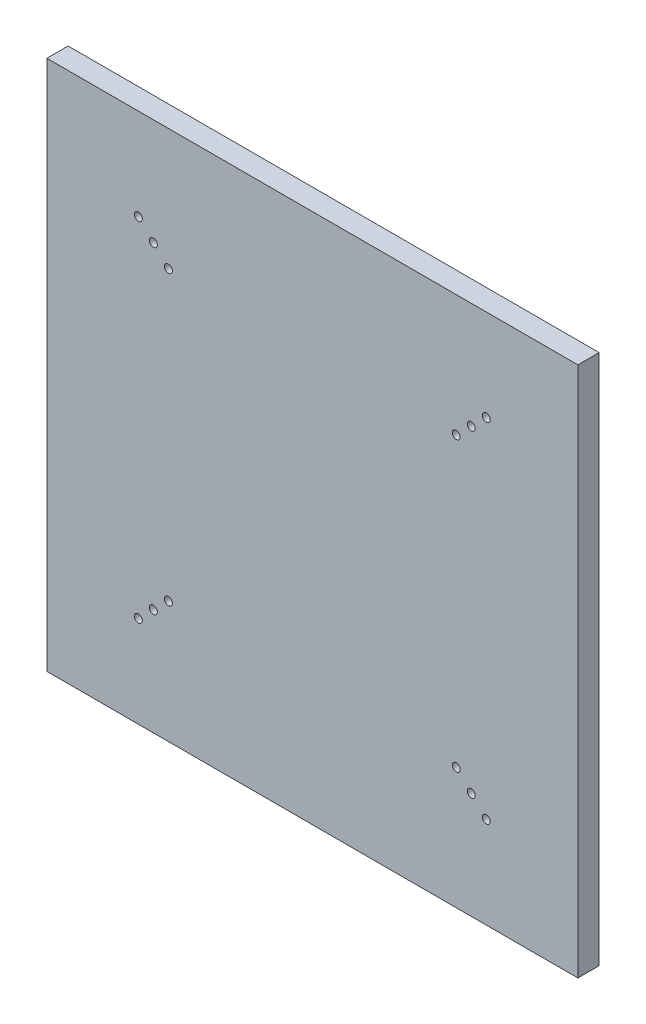
ISO-10303-21;
HEADER;
FILE_DESCRIPTION(('STEP AP214'),'2;1');
FILE_NAME('part.step','',(''),(''),'','','');
FILE_SCHEMA(('AUTOMOTIVE_DESIGN { 1 0 10303 214 1 1 1 1 }'));
ENDSEC;
DATA;
#1=APPLICATION_CONTEXT('core data for automotive mechanical design processes');
#2=APPLICATION_PROTOCOL_DEFINITION('international standard','automotive_design',2000,#1);
#3=PRODUCT_CONTEXT('',#1,'mechanical');
#4=PRODUCT('Part','Part','',(#3));
#5=PRODUCT_RELATED_PRODUCT_CATEGORY('part','',(#4));
#6=PRODUCT_DEFINITION_FORMATION('','',#4);
#7=PRODUCT_DEFINITION_CONTEXT('part definition',#1,'design');
#8=PRODUCT_DEFINITION('design','',#6,#7);
#9=PRODUCT_DEFINITION_SHAPE('','',#8);
#10=(LENGTH_UNIT() NAMED_UNIT(*) SI_UNIT(.MILLI.,.METRE.));
#11=(NAMED_UNIT(*) PLANE_ANGLE_UNIT() SI_UNIT($,.RADIAN.));
#12=(NAMED_UNIT(*) SI_UNIT($,.STERADIAN.) SOLID_ANGLE_UNIT());
#13=UNCERTAINTY_MEASURE_WITH_UNIT(LENGTH_MEASURE(1.E-05),#10,'distance_accuracy_value','');
#14=(GEOMETRIC_REPRESENTATION_CONTEXT(3) GLOBAL_UNCERTAINTY_ASSIGNED_CONTEXT((#13)) GLOBAL_UNIT_ASSIGNED_CONTEXT((#10,
#11,#12)) REPRESENTATION_CONTEXT('',''));
#15=CARTESIAN_POINT('',(0.,0.,0.));
#16=DIRECTION('',(0.,0.,1.));
#17=DIRECTION('',(1.,0.,0.));
#18=AXIS2_PLACEMENT_3D('',#15,#16,#17);
#19=CARTESIAN_POINT('',(0.,0.,8.));
#20=DIRECTION('',(1.,0.,0.));
#21=DIRECTION('',(0.,0.,-1.));
#22=AXIS2_PLACEMENT_3D('',#19,#20,#21);
#23=PLANE('',#22);
#24=DIRECTION('',(0.,-1.,0.));
#25=VECTOR('',#24,1.);
#26=CARTESIAN_POINT('',(0.,0.,0.));
#27=LINE('',#26,#25);
#28=CARTESIAN_POINT('',(0.,200.,0.));
#29=VERTEX_POINT('',#28);
#30=CARTESIAN_POINT('',(0.,0.,0.));
#31=VERTEX_POINT('',#30);
#32=EDGE_CURVE('E101',#29,#31,#27,.T.);
#33=ORIENTED_EDGE('',*,*,#32,.T.);
#34=DIRECTION('',(0.,0.,-1.));
#35=VECTOR('',#34,1.);
#36=CARTESIAN_POINT('',(0.,0.,8.));
#37=LINE('',#36,#35);
#38=CARTESIAN_POINT('',(0.,0.,8.));
#39=VERTEX_POINT('',#38);
#40=EDGE_CURVE('E11',#39,#31,#37,.T.);
#41=ORIENTED_EDGE('',*,*,#40,.F.);
#42=DIRECTION('',(0.,-1.,0.));
#43=VECTOR('',#42,1.);
#44=CARTESIAN_POINT('',(0.,0.,8.));
#45=LINE('',#44,#43);
#46=CARTESIAN_POINT('',(0.,200.,8.));
#47=VERTEX_POINT('',#46);
#48=EDGE_CURVE('E88',#47,#39,#45,.T.);
#49=ORIENTED_EDGE('',*,*,#48,.F.);
#50=DIRECTION('',(0.,0.,-1.));
#51=VECTOR('',#50,1.);
#52=CARTESIAN_POINT('',(0.,200.,8.));
#53=LINE('',#52,#51);
#54=EDGE_CURVE('E97',#47,#29,#53,.T.);
#55=ORIENTED_EDGE('',*,*,#54,.T.);
#56=EDGE_LOOP('',(#33,#41,#49,#55));
#57=FACE_BOUND('',#56,.T.);
#58=ADVANCED_FACE('F35',(#57),#23,.F.);
#59=CARTESIAN_POINT('',(0.,0.,8.));
#60=DIRECTION('',(0.,1.,0.));
#61=DIRECTION('',(0.,0.,1.));
#62=AXIS2_PLACEMENT_3D('',#59,#60,#61);
#63=PLANE('',#62);
#64=DIRECTION('',(1.,0.,0.));
#65=VECTOR('',#64,1.);
#66=CARTESIAN_POINT('',(0.,0.,0.));
#67=LINE('',#66,#65);
#68=CARTESIAN_POINT('',(200.,0.,0.));
#69=VERTEX_POINT('',#68);
#70=EDGE_CURVE('E92',#31,#69,#67,.T.);
#71=ORIENTED_EDGE('',*,*,#70,.T.);
#72=DIRECTION('',(0.,0.,-1.));
#73=VECTOR('',#72,1.);
#74=CARTESIAN_POINT('',(200.,0.,8.));
#75=LINE('',#74,#73);
#76=CARTESIAN_POINT('',(200.,0.,8.));
#77=VERTEX_POINT('',#76);
#78=EDGE_CURVE('E44',#77,#69,#75,.T.);
#79=ORIENTED_EDGE('',*,*,#78,.F.);
#80=DIRECTION('',(1.,0.,0.));
#81=VECTOR('',#80,1.);
#82=CARTESIAN_POINT('',(0.,0.,8.));
#83=LINE('',#82,#81);
#84=EDGE_CURVE('E83',#39,#77,#83,.T.);
#85=ORIENTED_EDGE('',*,*,#84,.F.);
#86=ORIENTED_EDGE('',*,*,#40,.T.);
#87=EDGE_LOOP('',(#71,#79,#85,#86));
#88=FACE_BOUND('',#87,.T.);
#89=ADVANCED_FACE('F91',(#88),#63,.F.);
#90=CARTESIAN_POINT('',(200.,0.,8.));
#91=DIRECTION('',(-1.,0.,0.));
#92=DIRECTION('',(0.,0.,1.));
#93=AXIS2_PLACEMENT_3D('',#90,#91,#92);
#94=PLANE('',#93);
#95=DIRECTION('',(0.,1.,0.));
#96=VECTOR('',#95,1.);
#97=CARTESIAN_POINT('',(200.,0.,0.));
#98=LINE('',#97,#96);
#99=CARTESIAN_POINT('',(200.,200.,0.));
#100=VERTEX_POINT('',#99);
#101=EDGE_CURVE('E70',#69,#100,#98,.T.);
#102=ORIENTED_EDGE('',*,*,#101,.T.);
#103=DIRECTION('',(0.,0.,-1.));
#104=VECTOR('',#103,1.);
#105=CARTESIAN_POINT('',(200.,200.,8.));
#106=LINE('',#105,#104);
#107=CARTESIAN_POINT('',(200.,200.,8.));
#108=VERTEX_POINT('',#107);
#109=EDGE_CURVE('E93',#108,#100,#106,.T.);
#110=ORIENTED_EDGE('',*,*,#109,.F.);
#111=DIRECTION('',(0.,1.,0.));
#112=VECTOR('',#111,1.);
#113=CARTESIAN_POINT('',(200.,0.,8.));
#114=LINE('',#113,#112);
#115=EDGE_CURVE('E86',#77,#108,#114,.T.);
#116=ORIENTED_EDGE('',*,*,#115,.F.);
#117=ORIENTED_EDGE('',*,*,#78,.T.);
#118=EDGE_LOOP('',(#102,#110,#116,#117));
#119=FACE_BOUND('',#118,.T.);
#120=ADVANCED_FACE('F95',(#119),#94,.F.);
#121=CARTESIAN_POINT('',(0.,200.,8.));
#122=DIRECTION('',(0.,-1.,0.));
#123=DIRECTION('',(0.,0.,-1.));
#124=AXIS2_PLACEMENT_3D('',#121,#122,#123);
#125=PLANE('',#124);
#126=DIRECTION('',(-1.,0.,0.));
#127=VECTOR('',#126,1.);
#128=CARTESIAN_POINT('',(0.,200.,0.));
#129=LINE('',#128,#127);
#130=EDGE_CURVE('E76',#100,#29,#129,.T.);
#131=ORIENTED_EDGE('',*,*,#130,.T.);
#132=ORIENTED_EDGE('',*,*,#54,.F.);
#133=DIRECTION('',(-1.,0.,0.));
#134=VECTOR('',#133,1.);
#135=CARTESIAN_POINT('',(0.,200.,8.));
#136=LINE('',#135,#134);
#137=EDGE_CURVE('E53',#108,#47,#136,.T.);
#138=ORIENTED_EDGE('',*,*,#137,.F.);
#139=ORIENTED_EDGE('',*,*,#109,.T.);
#140=EDGE_LOOP('',(#131,#132,#138,#139));
#141=FACE_BOUND('',#140,.T.);
#142=ADVANCED_FACE('F237',(#141),#125,.F.);
#143=CARTESIAN_POINT('',(0.,0.,8.));
#144=DIRECTION('',(0.,0.,-1.));
#145=DIRECTION('',(-1.,0.,0.));
#146=AXIS2_PLACEMENT_3D('',#143,#144,#145);
#147=PLANE('',#146);
#148=CARTESIAN_POINT('',(165.495689011695,165.559169034978,8.));
#149=DIRECTION('',(0.,0.,1.));
#150=DIRECTION('',(0.,1.,0.));
#151=AXIS2_PLACEMENT_3D('',#148,#149,#150);
#152=CIRCLE('',#151,1.5);
#153=CARTESIAN_POINT('',(165.495689011695,167.059169034978,8.));
#154=VERTEX_POINT('',#153);
#155=EDGE_CURVE('E161',#154,#154,#152,.T.);
#156=ORIENTED_EDGE('',*,*,#155,.F.);
#157=EDGE_LOOP('',(#156));
#158=FACE_BOUND('',#157,.T.);
#159=CARTESIAN_POINT('',(45.7545394640067,154.245460535993,8.));
#160=DIRECTION('',(0.,0.,1.));
#161=DIRECTION('',(-1.,0.,0.));
#162=AXIS2_PLACEMENT_3D('',#159,#160,#161);
#163=CIRCLE('',#162,1.5);
#164=CARTESIAN_POINT('',(44.2545394640067,154.245460535993,8.));
#165=VERTEX_POINT('',#164);
#166=EDGE_CURVE('E181',#165,#165,#163,.T.);
#167=ORIENTED_EDGE('',*,*,#166,.F.);
#168=EDGE_LOOP('',(#167));
#169=FACE_BOUND('',#168,.T.);
#170=CARTESIAN_POINT('',(34.4408309650227,34.5043109883043,8.));
#171=DIRECTION('',(0.,0.,1.));
#172=DIRECTION('',(0.,-1.,0.));
#173=AXIS2_PLACEMENT_3D('',#170,#171,#172);
#174=CIRCLE('',#173,1.5);
#175=CARTESIAN_POINT('',(34.4408309650227,33.0043109883043,8.));
#176=VERTEX_POINT('',#175);
#177=EDGE_CURVE('E173',#176,#176,#174,.T.);
#178=ORIENTED_EDGE('',*,*,#177,.F.);
#179=EDGE_LOOP('',(#178));
#180=FACE_BOUND('',#179,.T.);
#181=CARTESIAN_POINT('',(40.097685214515,40.1611652377968,8.));
#182=DIRECTION('',(0.,0.,1.));
#183=DIRECTION('',(0.,-1.,0.));
#184=AXIS2_PLACEMENT_3D('',#181,#182,#183);
#185=CIRCLE('',#184,1.5);
#186=CARTESIAN_POINT('',(40.097685214515,38.6611652377968,8.));
#187=VERTEX_POINT('',#186);
#188=EDGE_CURVE('E170',#187,#187,#185,.T.);
#189=ORIENTED_EDGE('',*,*,#188,.F.);
#190=EDGE_LOOP('',(#189));
#191=FACE_BOUND('',#190,.T.);
#192=CARTESIAN_POINT('',(45.7545394640074,45.8180194872892,8.));
#193=DIRECTION('',(0.,0.,1.));
#194=DIRECTION('',(0.,-1.,0.));
#195=AXIS2_PLACEMENT_3D('',#192,#193,#194);
#196=CIRCLE('',#195,1.5);
#197=CARTESIAN_POINT('',(45.7545394640074,44.3180194872892,8.));
#198=VERTEX_POINT('',#197);
#199=EDGE_CURVE('E174',#198,#198,#196,.T.);
#200=ORIENTED_EDGE('',*,*,#199,.F.);
#201=EDGE_LOOP('',(#200));
#202=FACE_BOUND('',#201,.T.);
#203=CARTESIAN_POINT('',(40.0976852145144,159.902314785486,8.));
#204=DIRECTION('',(0.,0.,1.));
#205=DIRECTION('',(-1.,0.,0.));
#206=AXIS2_PLACEMENT_3D('',#203,#204,#205);
#207=CIRCLE('',#206,1.5);
#208=CARTESIAN_POINT('',(38.5976852145144,159.902314785486,8.));
#209=VERTEX_POINT('',#208);
#210=EDGE_CURVE('E184',#209,#209,#207,.T.);
#211=ORIENTED_EDGE('',*,*,#210,.F.);
#212=EDGE_LOOP('',(#211));
#213=FACE_BOUND('',#212,.T.);
#214=CARTESIAN_POINT('',(34.440830965022,165.559169034978,8.));
#215=DIRECTION('',(0.,0.,1.));
#216=DIRECTION('',(-1.,0.,0.));
#217=AXIS2_PLACEMENT_3D('',#214,#215,#216);
#218=CIRCLE('',#217,1.5);
#219=CARTESIAN_POINT('',(32.940830965022,165.559169034978,8.));
#220=VERTEX_POINT('',#219);
#221=EDGE_CURVE('E200',#220,#220,#218,.T.);
#222=ORIENTED_EDGE('',*,*,#221,.F.);
#223=EDGE_LOOP('',(#222));
#224=FACE_BOUND('',#223,.T.);
#225=CARTESIAN_POINT('',(154.18198051271,154.245460535993,8.));
#226=DIRECTION('',(0.,0.,1.));
#227=DIRECTION('',(0.,1.,0.));
#228=AXIS2_PLACEMENT_3D('',#225,#226,#227);
#229=CIRCLE('',#228,1.5);
#230=CARTESIAN_POINT('',(154.18198051271,155.745460535993,8.));
#231=VERTEX_POINT('',#230);
#232=EDGE_CURVE('E194',#231,#231,#229,.T.);
#233=ORIENTED_EDGE('',*,*,#232,.F.);
#234=EDGE_LOOP('',(#233));
#235=FACE_BOUND('',#234,.T.);
#236=CARTESIAN_POINT('',(159.838834762202,159.902314785486,8.));
#237=DIRECTION('',(0.,0.,1.));
#238=DIRECTION('',(0.,1.,0.));
#239=AXIS2_PLACEMENT_3D('',#236,#237,#238);
#240=CIRCLE('',#239,1.5);
#241=CARTESIAN_POINT('',(159.838834762202,161.402314785486,8.));
#242=VERTEX_POINT('',#241);
#243=EDGE_CURVE('E165',#242,#242,#240,.T.);
#244=ORIENTED_EDGE('',*,*,#243,.F.);
#245=EDGE_LOOP('',(#244));
#246=FACE_BOUND('',#245,.T.);
#247=CARTESIAN_POINT('',(165.495689011695,34.5043109883051,8.));
#248=DIRECTION('',(0.,0.,1.));
#249=DIRECTION('',(1.,0.,0.));
#250=AXIS2_PLACEMENT_3D('',#247,#248,#249);
#251=CIRCLE('',#250,1.5);
#252=CARTESIAN_POINT('',(166.995689011695,34.5043109883051,8.));
#253=VERTEX_POINT('',#252);
#254=EDGE_CURVE('E104',#253,#253,#251,.T.);
#255=ORIENTED_EDGE('',*,*,#254,.F.);
#256=EDGE_LOOP('',(#255));
#257=FACE_BOUND('',#256,.T.);
#258=CARTESIAN_POINT('',(159.838834762203,40.1611652377974,8.));
#259=DIRECTION('',(0.,0.,1.));
#260=DIRECTION('',(1.,0.,0.));
#261=AXIS2_PLACEMENT_3D('',#258,#259,#260);
#262=CIRCLE('',#261,1.5);
#263=CARTESIAN_POINT('',(161.338834762203,40.1611652377974,8.));
#264=VERTEX_POINT('',#263);
#265=EDGE_CURVE('E221',#264,#264,#262,.T.);
#266=ORIENTED_EDGE('',*,*,#265,.F.);
#267=EDGE_LOOP('',(#266));
#268=FACE_BOUND('',#267,.T.);
#269=CARTESIAN_POINT('',(154.18198051271,45.8180194872898,8.));
#270=DIRECTION('',(0.,0.,1.));
#271=DIRECTION('',(1.,0.,0.));
#272=AXIS2_PLACEMENT_3D('',#269,#270,#271);
#273=CIRCLE('',#272,1.5);
#274=CARTESIAN_POINT('',(155.68198051271,45.8180194872898,8.));
#275=VERTEX_POINT('',#274);
#276=EDGE_CURVE('E227',#275,#275,#273,.T.);
#277=ORIENTED_EDGE('',*,*,#276,.F.);
#278=EDGE_LOOP('',(#277));
#279=FACE_BOUND('',#278,.T.);
#280=ORIENTED_EDGE('',*,*,#48,.T.);
#281=ORIENTED_EDGE('',*,*,#84,.T.);
#282=ORIENTED_EDGE('',*,*,#115,.T.);
#283=ORIENTED_EDGE('',*,*,#137,.T.);
#284=EDGE_LOOP('',(#280,#281,#282,#283));
#285=FACE_BOUND('',#284,.T.);
#286=ADVANCED_FACE('F84',(#158,#169,#180,#191,#202,#213,#224,#235,#246,#257,#268,#279,#285),
#147,.F.);
#287=CARTESIAN_POINT('',(0.,0.,0.));
#288=DIRECTION('',(0.,0.,-1.));
#289=DIRECTION('',(-1.,0.,0.));
#290=AXIS2_PLACEMENT_3D('',#287,#288,#289);
#291=PLANE('',#290);
#292=CARTESIAN_POINT('',(159.838834762202,159.902314785486,0.));
#293=DIRECTION('',(0.,0.,-1.));
#294=DIRECTION('',(-1.,0.,0.));
#295=AXIS2_PLACEMENT_3D('',#292,#293,#294);
#296=CIRCLE('',#295,2.5);
#297=CARTESIAN_POINT('',(157.338834762202,159.902314785486,0.));
#298=VERTEX_POINT('',#297);
#299=EDGE_CURVE('E38',#298,#298,#296,.T.);
#300=ORIENTED_EDGE('',*,*,#299,.F.);
#301=EDGE_LOOP('',(#300));
#302=FACE_BOUND('',#301,.T.);
#303=CARTESIAN_POINT('',(165.495689011695,165.559169034978,0.));
#304=DIRECTION('',(0.,0.,-1.));
#305=DIRECTION('',(-1.,0.,0.));
#306=AXIS2_PLACEMENT_3D('',#303,#304,#305);
#307=CIRCLE('',#306,2.5);
#308=CARTESIAN_POINT('',(162.995689011695,165.559169034978,0.));
#309=VERTEX_POINT('',#308);
#310=EDGE_CURVE('E142',#309,#309,#307,.T.);
#311=ORIENTED_EDGE('',*,*,#310,.F.);
#312=EDGE_LOOP('',(#311));
#313=FACE_BOUND('',#312,.T.);
#314=CARTESIAN_POINT('',(45.7545394640067,154.245460535993,0.));
#315=DIRECTION('',(0.,0.,-1.));
#316=DIRECTION('',(-1.,0.,0.));
#317=AXIS2_PLACEMENT_3D('',#314,#315,#316);
#318=CIRCLE('',#317,2.5);
#319=CARTESIAN_POINT('',(43.2545394640067,154.245460535993,0.));
#320=VERTEX_POINT('',#319);
#321=EDGE_CURVE('E140',#320,#320,#318,.T.);
#322=ORIENTED_EDGE('',*,*,#321,.F.);
#323=EDGE_LOOP('',(#322));
#324=FACE_BOUND('',#323,.T.);
#325=CARTESIAN_POINT('',(40.0976852145144,159.902314785486,0.));
#326=DIRECTION('',(0.,0.,-1.));
#327=DIRECTION('',(-1.,0.,0.));
#328=AXIS2_PLACEMENT_3D('',#325,#326,#327);
#329=CIRCLE('',#328,2.5);
#330=CARTESIAN_POINT('',(37.5976852145144,159.902314785486,0.));
#331=VERTEX_POINT('',#330);
#332=EDGE_CURVE('E137',#331,#331,#329,.T.);
#333=ORIENTED_EDGE('',*,*,#332,.F.);
#334=EDGE_LOOP('',(#333));
#335=FACE_BOUND('',#334,.T.);
#336=CARTESIAN_POINT('',(34.440830965022,165.559169034978,0.));
#337=DIRECTION('',(0.,0.,-1.));
#338=DIRECTION('',(-1.,0.,0.));
#339=AXIS2_PLACEMENT_3D('',#336,#337,#338);
#340=CIRCLE('',#339,2.5);
#341=CARTESIAN_POINT('',(31.940830965022,165.559169034978,0.));
#342=VERTEX_POINT('',#341);
#343=EDGE_CURVE('E134',#342,#342,#340,.T.);
#344=ORIENTED_EDGE('',*,*,#343,.F.);
#345=EDGE_LOOP('',(#344));
#346=FACE_BOUND('',#345,.T.);
#347=CARTESIAN_POINT('',(45.7545394640074,45.8180194872892,0.));
#348=DIRECTION('',(0.,0.,-1.));
#349=DIRECTION('',(-1.,0.,0.));
#350=AXIS2_PLACEMENT_3D('',#347,#348,#349);
#351=CIRCLE('',#350,2.5);
#352=CARTESIAN_POINT('',(43.2545394640074,45.8180194872892,0.));
#353=VERTEX_POINT('',#352);
#354=EDGE_CURVE('E131',#353,#353,#351,.T.);
#355=ORIENTED_EDGE('',*,*,#354,.F.);
#356=EDGE_LOOP('',(#355));
#357=FACE_BOUND('',#356,.T.);
#358=CARTESIAN_POINT('',(40.097685214515,40.1611652377968,0.));
#359=DIRECTION('',(0.,0.,-1.));
#360=DIRECTION('',(-1.,0.,0.));
#361=AXIS2_PLACEMENT_3D('',#358,#359,#360);
#362=CIRCLE('',#361,2.5);
#363=CARTESIAN_POINT('',(37.597685214515,40.1611652377968,0.));
#364=VERTEX_POINT('',#363);
#365=EDGE_CURVE('E128',#364,#364,#362,.T.);
#366=ORIENTED_EDGE('',*,*,#365,.F.);
#367=EDGE_LOOP('',(#366));
#368=FACE_BOUND('',#367,.T.);
#369=CARTESIAN_POINT('',(34.4408309650227,34.5043109883043,0.));
#370=DIRECTION('',(0.,0.,-1.));
#371=DIRECTION('',(-1.,0.,0.));
#372=AXIS2_PLACEMENT_3D('',#369,#370,#371);
#373=CIRCLE('',#372,2.5);
#374=CARTESIAN_POINT('',(31.9408309650227,34.5043109883043,0.));
#375=VERTEX_POINT('',#374);
#376=EDGE_CURVE('E124',#375,#375,#373,.T.);
#377=ORIENTED_EDGE('',*,*,#376,.F.);
#378=EDGE_LOOP('',(#377));
#379=FACE_BOUND('',#378,.T.);
#380=CARTESIAN_POINT('',(154.18198051271,154.245460535993,0.));
#381=DIRECTION('',(0.,0.,-1.));
#382=DIRECTION('',(-1.,0.,0.));
#383=AXIS2_PLACEMENT_3D('',#380,#381,#382);
#384=CIRCLE('',#383,2.5);
#385=CARTESIAN_POINT('',(151.68198051271,154.245460535993,0.));
#386=VERTEX_POINT('',#385);
#387=EDGE_CURVE('E121',#386,#386,#384,.T.);
#388=ORIENTED_EDGE('',*,*,#387,.F.);
#389=EDGE_LOOP('',(#388));
#390=FACE_BOUND('',#389,.T.);
#391=CARTESIAN_POINT('',(154.18198051271,45.8180194872898,0.));
#392=DIRECTION('',(0.,0.,-1.));
#393=DIRECTION('',(-1.,0.,0.));
#394=AXIS2_PLACEMENT_3D('',#391,#392,#393);
#395=CIRCLE('',#394,2.5);
#396=CARTESIAN_POINT('',(151.68198051271,45.8180194872898,0.));
#397=VERTEX_POINT('',#396);
#398=EDGE_CURVE('E117',#397,#397,#395,.T.);
#399=ORIENTED_EDGE('',*,*,#398,.F.);
#400=EDGE_LOOP('',(#399));
#401=FACE_BOUND('',#400,.T.);
#402=CARTESIAN_POINT('',(159.838834762203,40.1611652377974,0.));
#403=DIRECTION('',(0.,0.,-1.));
#404=DIRECTION('',(-1.,0.,0.));
#405=AXIS2_PLACEMENT_3D('',#402,#403,#404);
#406=CIRCLE('',#405,2.5);
#407=CARTESIAN_POINT('',(157.338834762203,40.1611652377974,0.));
#408=VERTEX_POINT('',#407);
#409=EDGE_CURVE('E113',#408,#408,#406,.T.);
#410=ORIENTED_EDGE('',*,*,#409,.F.);
#411=EDGE_LOOP('',(#410));
#412=FACE_BOUND('',#411,.T.);
#413=CARTESIAN_POINT('',(165.495689011695,34.5043109883051,0.));
#414=DIRECTION('',(0.,0.,-1.));
#415=DIRECTION('',(-1.,0.,0.));
#416=AXIS2_PLACEMENT_3D('',#413,#414,#415);
#417=CIRCLE('',#416,2.5);
#418=CARTESIAN_POINT('',(162.995689011695,34.5043109883051,0.));
#419=VERTEX_POINT('',#418);
#420=EDGE_CURVE('E110',#419,#419,#417,.T.);
#421=ORIENTED_EDGE('',*,*,#420,.F.);
#422=EDGE_LOOP('',(#421));
#423=FACE_BOUND('',#422,.T.);
#424=ORIENTED_EDGE('',*,*,#32,.F.);
#425=ORIENTED_EDGE('',*,*,#130,.F.);
#426=ORIENTED_EDGE('',*,*,#101,.F.);
#427=ORIENTED_EDGE('',*,*,#70,.F.);
#428=EDGE_LOOP('',(#424,#425,#426,#427));
#429=FACE_BOUND('',#428,.T.);
#430=ADVANCED_FACE('F236',(#302,#313,#324,#335,#346,#357,#368,#379,#390,#401,#412,#423,#429),
#291,.T.);
#431=CARTESIAN_POINT('',(154.18198051271,45.8180194872898,4.));
#432=DIRECTION('',(0.,0.,1.));
#433=DIRECTION('',(1.,0.,0.));
#434=AXIS2_PLACEMENT_3D('',#431,#432,#433);
#435=CYLINDRICAL_SURFACE('',#434,1.5);
#436=CARTESIAN_POINT('',(154.18198051271,45.8180194872898,4.));
#437=DIRECTION('',(0.,0.,1.));
#438=DIRECTION('',(1.,0.,0.));
#439=AXIS2_PLACEMENT_3D('',#436,#437,#438);
#440=CIRCLE('',#439,1.5);
#441=CARTESIAN_POINT('',(155.68198051271,45.8180194872898,4.));
#442=VERTEX_POINT('',#441);
#443=EDGE_CURVE('E224',#442,#442,#440,.T.);
#444=ORIENTED_EDGE('',*,*,#443,.F.);
#445=EDGE_LOOP('',(#444));
#446=FACE_BOUND('',#445,.T.);
#447=ORIENTED_EDGE('',*,*,#276,.T.);
#448=EDGE_LOOP('',(#447));
#449=FACE_BOUND('',#448,.T.);
#450=ADVANCED_FACE('F233',(#446,#449),#435,.F.);
#451=CARTESIAN_POINT('',(159.838834762203,40.1611652377974,4.));
#452=DIRECTION('',(0.,0.,1.));
#453=DIRECTION('',(1.,0.,0.));
#454=AXIS2_PLACEMENT_3D('',#451,#452,#453);
#455=CYLINDRICAL_SURFACE('',#454,1.5);
#456=CARTESIAN_POINT('',(159.838834762203,40.1611652377974,4.));
#457=DIRECTION('',(0.,0.,1.));
#458=DIRECTION('',(1.,0.,0.));
#459=AXIS2_PLACEMENT_3D('',#456,#457,#458);
#460=CIRCLE('',#459,1.5);
#461=CARTESIAN_POINT('',(161.338834762203,40.1611652377974,4.));
#462=VERTEX_POINT('',#461);
#463=EDGE_CURVE('E218',#462,#462,#460,.T.);
#464=ORIENTED_EDGE('',*,*,#463,.F.);
#465=EDGE_LOOP('',(#464));
#466=FACE_BOUND('',#465,.T.);
#467=ORIENTED_EDGE('',*,*,#265,.T.);
#468=EDGE_LOOP('',(#467));
#469=FACE_BOUND('',#468,.T.);
#470=ADVANCED_FACE('F277',(#466,#469),#455,.F.);
#471=CARTESIAN_POINT('',(165.495689011695,34.5043109883051,4.));
#472=DIRECTION('',(0.,0.,1.));
#473=DIRECTION('',(1.,0.,0.));
#474=AXIS2_PLACEMENT_3D('',#471,#472,#473);
#475=CYLINDRICAL_SURFACE('',#474,1.5);
#476=CARTESIAN_POINT('',(165.495689011695,34.5043109883051,4.));
#477=DIRECTION('',(0.,0.,1.));
#478=DIRECTION('',(1.,0.,0.));
#479=AXIS2_PLACEMENT_3D('',#476,#477,#478);
#480=CIRCLE('',#479,1.5);
#481=CARTESIAN_POINT('',(166.995689011695,34.5043109883051,4.));
#482=VERTEX_POINT('',#481);
#483=EDGE_CURVE('E120',#482,#482,#480,.T.);
#484=ORIENTED_EDGE('',*,*,#483,.F.);
#485=EDGE_LOOP('',(#484));
#486=FACE_BOUND('',#485,.T.);
#487=ORIENTED_EDGE('',*,*,#254,.T.);
#488=EDGE_LOOP('',(#487));
#489=FACE_BOUND('',#488,.T.);
#490=ADVANCED_FACE('F287',(#486,#489),#475,.F.);
#491=CARTESIAN_POINT('',(165.495689011695,34.5043109883051,-6.));
#492=DIRECTION('',(0.,0.,1.));
#493=DIRECTION('',(1.,0.,0.));
#494=AXIS2_PLACEMENT_3D('',#491,#492,#493);
#495=CYLINDRICAL_SURFACE('',#494,2.5);
#496=ORIENTED_EDGE('',*,*,#420,.T.);
#497=EDGE_LOOP('',(#496));
#498=FACE_BOUND('',#497,.T.);
#499=CARTESIAN_POINT('',(165.495689011695,34.5043109883051,4.));
#500=DIRECTION('',(0.,0.,1.));
#501=DIRECTION('',(1.,0.,0.));
#502=AXIS2_PLACEMENT_3D('',#499,#500,#501);
#503=CIRCLE('',#502,2.5);
#504=CARTESIAN_POINT('',(167.995689011695,34.5043109883051,4.));
#505=VERTEX_POINT('',#504);
#506=EDGE_CURVE('E164',#505,#505,#503,.T.);
#507=ORIENTED_EDGE('',*,*,#506,.T.);
#508=EDGE_LOOP('',(#507));
#509=FACE_BOUND('',#508,.T.);
#510=ADVANCED_FACE('F297',(#498,#509),#495,.F.);
#511=CARTESIAN_POINT('',(165.495689011695,34.5043109883051,4.));
#512=DIRECTION('',(0.,0.,1.));
#513=DIRECTION('',(1.,0.,0.));
#514=AXIS2_PLACEMENT_3D('',#511,#512,#513);
#515=PLANE('',#514);
#516=ORIENTED_EDGE('',*,*,#483,.T.);
#517=EDGE_LOOP('',(#516));
#518=FACE_BOUND('',#517,.T.);
#519=ORIENTED_EDGE('',*,*,#506,.F.);
#520=EDGE_LOOP('',(#519));
#521=FACE_BOUND('',#520,.T.);
#522=ADVANCED_FACE('F307',(#518,#521),#515,.F.);
#523=CARTESIAN_POINT('',(159.838834762203,40.1611652377974,-6.));
#524=DIRECTION('',(0.,0.,1.));
#525=DIRECTION('',(1.,0.,0.));
#526=AXIS2_PLACEMENT_3D('',#523,#524,#525);
#527=CYLINDRICAL_SURFACE('',#526,2.5);
#528=ORIENTED_EDGE('',*,*,#409,.T.);
#529=EDGE_LOOP('',(#528));
#530=FACE_BOUND('',#529,.T.);
#531=CARTESIAN_POINT('',(159.838834762203,40.1611652377974,4.));
#532=DIRECTION('',(0.,0.,1.));
#533=DIRECTION('',(1.,0.,0.));
#534=AXIS2_PLACEMENT_3D('',#531,#532,#533);
#535=CIRCLE('',#534,2.5);
#536=CARTESIAN_POINT('',(162.338834762203,40.1611652377974,4.));
#537=VERTEX_POINT('',#536);
#538=EDGE_CURVE('E211',#537,#537,#535,.T.);
#539=ORIENTED_EDGE('',*,*,#538,.T.);
#540=EDGE_LOOP('',(#539));
#541=FACE_BOUND('',#540,.T.);
#542=ADVANCED_FACE('F317',(#530,#541),#527,.F.);
#543=CARTESIAN_POINT('',(159.838834762203,40.1611652377974,4.));
#544=DIRECTION('',(0.,0.,1.));
#545=DIRECTION('',(1.,0.,0.));
#546=AXIS2_PLACEMENT_3D('',#543,#544,#545);
#547=PLANE('',#546);
#548=ORIENTED_EDGE('',*,*,#463,.T.);
#549=EDGE_LOOP('',(#548));
#550=FACE_BOUND('',#549,.T.);
#551=ORIENTED_EDGE('',*,*,#538,.F.);
#552=EDGE_LOOP('',(#551));
#553=FACE_BOUND('',#552,.T.);
#554=ADVANCED_FACE('F327',(#550,#553),#547,.F.);
#555=CARTESIAN_POINT('',(154.18198051271,45.8180194872898,-6.));
#556=DIRECTION('',(0.,0.,1.));
#557=DIRECTION('',(1.,0.,0.));
#558=AXIS2_PLACEMENT_3D('',#555,#556,#557);
#559=CYLINDRICAL_SURFACE('',#558,2.5);
#560=ORIENTED_EDGE('',*,*,#398,.T.);
#561=EDGE_LOOP('',(#560));
#562=FACE_BOUND('',#561,.T.);
#563=CARTESIAN_POINT('',(154.18198051271,45.8180194872898,4.));
#564=DIRECTION('',(0.,0.,1.));
#565=DIRECTION('',(1.,0.,0.));
#566=AXIS2_PLACEMENT_3D('',#563,#564,#565);
#567=CIRCLE('',#566,2.5);
#568=CARTESIAN_POINT('',(156.68198051271,45.8180194872898,4.));
#569=VERTEX_POINT('',#568);
#570=EDGE_CURVE('E114',#569,#569,#567,.T.);
#571=ORIENTED_EDGE('',*,*,#570,.T.);
#572=EDGE_LOOP('',(#571));
#573=FACE_BOUND('',#572,.T.);
#574=ADVANCED_FACE('F337',(#562,#573),#559,.F.);
#575=CARTESIAN_POINT('',(154.18198051271,45.8180194872898,4.));
#576=DIRECTION('',(0.,0.,1.));
#577=DIRECTION('',(1.,0.,0.));
#578=AXIS2_PLACEMENT_3D('',#575,#576,#577);
#579=PLANE('',#578);
#580=ORIENTED_EDGE('',*,*,#443,.T.);
#581=EDGE_LOOP('',(#580));
#582=FACE_BOUND('',#581,.T.);
#583=ORIENTED_EDGE('',*,*,#570,.F.);
#584=EDGE_LOOP('',(#583));
#585=FACE_BOUND('',#584,.T.);
#586=ADVANCED_FACE('F347',(#582,#585),#579,.F.);
#587=CARTESIAN_POINT('',(159.838834762202,159.902314785486,4.));
#588=DIRECTION('',(0.,0.,1.));
#589=DIRECTION('',(1.,0.,0.));
#590=AXIS2_PLACEMENT_3D('',#587,#588,#589);
#591=CYLINDRICAL_SURFACE('',#590,1.5);
#592=CARTESIAN_POINT('',(159.838834762202,159.902314785486,4.));
#593=DIRECTION('',(0.,0.,1.));
#594=DIRECTION('',(0.,1.,0.));
#595=AXIS2_PLACEMENT_3D('',#592,#593,#594);
#596=CIRCLE('',#595,1.5);
#597=CARTESIAN_POINT('',(159.838834762202,161.402314785486,4.));
#598=VERTEX_POINT('',#597);
#599=EDGE_CURVE('E179',#598,#598,#596,.T.);
#600=ORIENTED_EDGE('',*,*,#599,.F.);
#601=EDGE_LOOP('',(#600));
#602=FACE_BOUND('',#601,.T.);
#603=ORIENTED_EDGE('',*,*,#243,.T.);
#604=EDGE_LOOP('',(#603));
#605=FACE_BOUND('',#604,.T.);
#606=ADVANCED_FACE('F356',(#602,#605),#591,.F.);
#607=CARTESIAN_POINT('',(154.18198051271,154.245460535993,4.));
#608=DIRECTION('',(0.,0.,1.));
#609=DIRECTION('',(1.,0.,0.));
#610=AXIS2_PLACEMENT_3D('',#607,#608,#609);
#611=CYLINDRICAL_SURFACE('',#610,1.5);
#612=CARTESIAN_POINT('',(154.18198051271,154.245460535993,4.));
#613=DIRECTION('',(0.,0.,1.));
#614=DIRECTION('',(0.,1.,0.));
#615=AXIS2_PLACEMENT_3D('',#612,#613,#614);
#616=CIRCLE('',#615,1.5);
#617=CARTESIAN_POINT('',(154.18198051271,155.745460535993,4.));
#618=VERTEX_POINT('',#617);
#619=EDGE_CURVE('E191',#618,#618,#616,.T.);
#620=ORIENTED_EDGE('',*,*,#619,.F.);
#621=EDGE_LOOP('',(#620));
#622=FACE_BOUND('',#621,.T.);
#623=ORIENTED_EDGE('',*,*,#232,.T.);
#624=EDGE_LOOP('',(#623));
#625=FACE_BOUND('',#624,.T.);
#626=ADVANCED_FACE('F375',(#622,#625),#611,.F.);
#627=CARTESIAN_POINT('',(34.440830965022,165.559169034978,4.));
#628=DIRECTION('',(0.,0.,1.));
#629=DIRECTION('',(1.,0.,0.));
#630=AXIS2_PLACEMENT_3D('',#627,#628,#629);
#631=CYLINDRICAL_SURFACE('',#630,1.5);
#632=CARTESIAN_POINT('',(34.440830965022,165.559169034978,4.));
#633=DIRECTION('',(0.,0.,1.));
#634=DIRECTION('',(-1.,0.,0.));
#635=AXIS2_PLACEMENT_3D('',#632,#633,#634);
#636=CIRCLE('',#635,1.5);
#637=CARTESIAN_POINT('',(32.940830965022,165.559169034978,4.));
#638=VERTEX_POINT('',#637);
#639=EDGE_CURVE('E197',#638,#638,#636,.T.);
#640=ORIENTED_EDGE('',*,*,#639,.F.);
#641=EDGE_LOOP('',(#640));
#642=FACE_BOUND('',#641,.T.);
#643=ORIENTED_EDGE('',*,*,#221,.T.);
#644=EDGE_LOOP('',(#643));
#645=FACE_BOUND('',#644,.T.);
#646=ADVANCED_FACE('F385',(#642,#645),#631,.F.);
#647=CARTESIAN_POINT('',(40.0976852145144,159.902314785486,4.));
#648=DIRECTION('',(0.,0.,1.));
#649=DIRECTION('',(1.,0.,0.));
#650=AXIS2_PLACEMENT_3D('',#647,#648,#649);
#651=CYLINDRICAL_SURFACE('',#650,1.5);
#652=CARTESIAN_POINT('',(40.0976852145144,159.902314785486,4.));
#653=DIRECTION('',(0.,0.,1.));
#654=DIRECTION('',(-1.,0.,0.));
#655=AXIS2_PLACEMENT_3D('',#652,#653,#654);
#656=CIRCLE('',#655,1.5);
#657=CARTESIAN_POINT('',(38.5976852145144,159.902314785486,4.));
#658=VERTEX_POINT('',#657);
#659=EDGE_CURVE('E177',#658,#658,#656,.T.);
#660=ORIENTED_EDGE('',*,*,#659,.F.);
#661=EDGE_LOOP('',(#660));
#662=FACE_BOUND('',#661,.T.);
#663=ORIENTED_EDGE('',*,*,#210,.T.);
#664=EDGE_LOOP('',(#663));
#665=FACE_BOUND('',#664,.T.);
#666=ADVANCED_FACE('F395',(#662,#665),#651,.F.);
#667=CARTESIAN_POINT('',(45.7545394640074,45.8180194872892,4.));
#668=DIRECTION('',(0.,0.,1.));
#669=DIRECTION('',(1.,0.,0.));
#670=AXIS2_PLACEMENT_3D('',#667,#668,#669);
#671=CYLINDRICAL_SURFACE('',#670,1.5);
#672=CARTESIAN_POINT('',(45.7545394640074,45.8180194872892,4.));
#673=DIRECTION('',(0.,0.,1.));
#674=DIRECTION('',(0.,-1.,0.));
#675=AXIS2_PLACEMENT_3D('',#672,#673,#674);
#676=CIRCLE('',#675,1.5);
#677=CARTESIAN_POINT('',(45.7545394640074,44.3180194872892,4.));
#678=VERTEX_POINT('',#677);
#679=EDGE_CURVE('E169',#678,#678,#676,.T.);
#680=ORIENTED_EDGE('',*,*,#679,.F.);
#681=EDGE_LOOP('',(#680));
#682=FACE_BOUND('',#681,.T.);
#683=ORIENTED_EDGE('',*,*,#199,.T.);
#684=EDGE_LOOP('',(#683));
#685=FACE_BOUND('',#684,.T.);
#686=ADVANCED_FACE('F405',(#682,#685),#671,.F.);
#687=CARTESIAN_POINT('',(40.097685214515,40.1611652377968,4.));
#688=DIRECTION('',(0.,0.,1.));
#689=DIRECTION('',(1.,0.,0.));
#690=AXIS2_PLACEMENT_3D('',#687,#688,#689);
#691=CYLINDRICAL_SURFACE('',#690,1.5);
#692=CARTESIAN_POINT('',(40.097685214515,40.1611652377968,4.));
#693=DIRECTION('',(0.,0.,1.));
#694=DIRECTION('',(0.,-1.,0.));
#695=AXIS2_PLACEMENT_3D('',#692,#693,#694);
#696=CIRCLE('',#695,1.5);
#697=CARTESIAN_POINT('',(40.097685214515,38.6611652377968,4.));
#698=VERTEX_POINT('',#697);
#699=EDGE_CURVE('E166',#698,#698,#696,.T.);
#700=ORIENTED_EDGE('',*,*,#699,.F.);
#701=EDGE_LOOP('',(#700));
#702=FACE_BOUND('',#701,.T.);
#703=ORIENTED_EDGE('',*,*,#188,.T.);
#704=EDGE_LOOP('',(#703));
#705=FACE_BOUND('',#704,.T.);
#706=ADVANCED_FACE('F415',(#702,#705),#691,.F.);
#707=CARTESIAN_POINT('',(34.4408309650227,34.5043109883043,4.));
#708=DIRECTION('',(0.,0.,1.));
#709=DIRECTION('',(1.,0.,0.));
#710=AXIS2_PLACEMENT_3D('',#707,#708,#709);
#711=CYLINDRICAL_SURFACE('',#710,1.5);
#712=CARTESIAN_POINT('',(34.4408309650227,34.5043109883043,4.));
#713=DIRECTION('',(0.,0.,1.));
#714=DIRECTION('',(0.,-1.,0.));
#715=AXIS2_PLACEMENT_3D('',#712,#713,#714);
#716=CIRCLE('',#715,1.5);
#717=CARTESIAN_POINT('',(34.4408309650227,33.0043109883043,4.));
#718=VERTEX_POINT('',#717);
#719=EDGE_CURVE('E156',#718,#718,#716,.T.);
#720=ORIENTED_EDGE('',*,*,#719,.F.);
#721=EDGE_LOOP('',(#720));
#722=FACE_BOUND('',#721,.T.);
#723=ORIENTED_EDGE('',*,*,#177,.T.);
#724=EDGE_LOOP('',(#723));
#725=FACE_BOUND('',#724,.T.);
#726=ADVANCED_FACE('F425',(#722,#725),#711,.F.);
#727=CARTESIAN_POINT('',(45.7545394640067,154.245460535993,4.));
#728=DIRECTION('',(0.,0.,1.));
#729=DIRECTION('',(1.,0.,0.));
#730=AXIS2_PLACEMENT_3D('',#727,#728,#729);
#731=CYLINDRICAL_SURFACE('',#730,1.5);
#732=CARTESIAN_POINT('',(45.7545394640067,154.245460535993,4.));
#733=DIRECTION('',(0.,0.,1.));
#734=DIRECTION('',(-1.,0.,0.));
#735=AXIS2_PLACEMENT_3D('',#732,#733,#734);
#736=CIRCLE('',#735,1.5);
#737=CARTESIAN_POINT('',(44.2545394640067,154.245460535993,4.));
#738=VERTEX_POINT('',#737);
#739=EDGE_CURVE('E151',#738,#738,#736,.T.);
#740=ORIENTED_EDGE('',*,*,#739,.F.);
#741=EDGE_LOOP('',(#740));
#742=FACE_BOUND('',#741,.T.);
#743=ORIENTED_EDGE('',*,*,#166,.T.);
#744=EDGE_LOOP('',(#743));
#745=FACE_BOUND('',#744,.T.);
#746=ADVANCED_FACE('F435',(#742,#745),#731,.F.);
#747=CARTESIAN_POINT('',(165.495689011695,165.559169034978,4.));
#748=DIRECTION('',(0.,0.,1.));
#749=DIRECTION('',(1.,0.,0.));
#750=AXIS2_PLACEMENT_3D('',#747,#748,#749);
#751=CYLINDRICAL_SURFACE('',#750,1.5);
#752=CARTESIAN_POINT('',(165.495689011695,165.559169034978,4.));
#753=DIRECTION('',(0.,0.,1.));
#754=DIRECTION('',(0.,1.,0.));
#755=AXIS2_PLACEMENT_3D('',#752,#753,#754);
#756=CIRCLE('',#755,1.5);
#757=CARTESIAN_POINT('',(165.495689011695,167.059169034978,4.));
#758=VERTEX_POINT('',#757);
#759=EDGE_CURVE('E147',#758,#758,#756,.T.);
#760=ORIENTED_EDGE('',*,*,#759,.F.);
#761=EDGE_LOOP('',(#760));
#762=FACE_BOUND('',#761,.T.);
#763=ORIENTED_EDGE('',*,*,#155,.T.);
#764=EDGE_LOOP('',(#763));
#765=FACE_BOUND('',#764,.T.);
#766=ADVANCED_FACE('F445',(#762,#765),#751,.F.);
#767=CARTESIAN_POINT('',(154.18198051271,154.245460535993,-6.));
#768=DIRECTION('',(0.,0.,1.));
#769=DIRECTION('',(1.,0.,0.));
#770=AXIS2_PLACEMENT_3D('',#767,#768,#769);
#771=CYLINDRICAL_SURFACE('',#770,2.5);
#772=ORIENTED_EDGE('',*,*,#387,.T.);
#773=EDGE_LOOP('',(#772));
#774=FACE_BOUND('',#773,.T.);
#775=CARTESIAN_POINT('',(154.18198051271,154.245460535993,4.));
#776=DIRECTION('',(0.,0.,1.));
#777=DIRECTION('',(0.,1.,0.));
#778=AXIS2_PLACEMENT_3D('',#775,#776,#777);
#779=CIRCLE('',#778,2.5);
#780=CARTESIAN_POINT('',(154.18198051271,156.745460535993,4.));
#781=VERTEX_POINT('',#780);
#782=EDGE_CURVE('E125',#781,#781,#779,.T.);
#783=ORIENTED_EDGE('',*,*,#782,.T.);
#784=EDGE_LOOP('',(#783));
#785=FACE_BOUND('',#784,.T.);
#786=ADVANCED_FACE('F455',(#774,#785),#771,.F.);
#787=CARTESIAN_POINT('',(154.18198051271,154.245460535993,4.));
#788=DIRECTION('',(0.,0.,1.));
#789=DIRECTION('',(0.,1.,0.));
#790=AXIS2_PLACEMENT_3D('',#787,#788,#789);
#791=PLANE('',#790);
#792=ORIENTED_EDGE('',*,*,#619,.T.);
#793=EDGE_LOOP('',(#792));
#794=FACE_BOUND('',#793,.T.);
#795=ORIENTED_EDGE('',*,*,#782,.F.);
#796=EDGE_LOOP('',(#795));
#797=FACE_BOUND('',#796,.T.);
#798=ADVANCED_FACE('F465',(#794,#797),#791,.F.);
#799=CARTESIAN_POINT('',(34.4408309650227,34.5043109883043,-6.));
#800=DIRECTION('',(0.,0.,1.));
#801=DIRECTION('',(1.,0.,0.));
#802=AXIS2_PLACEMENT_3D('',#799,#800,#801);
#803=CYLINDRICAL_SURFACE('',#802,2.5);
#804=ORIENTED_EDGE('',*,*,#376,.T.);
#805=EDGE_LOOP('',(#804));
#806=FACE_BOUND('',#805,.T.);
#807=CARTESIAN_POINT('',(34.4408309650227,34.5043109883043,4.));
#808=DIRECTION('',(0.,0.,1.));
#809=DIRECTION('',(0.,-1.,0.));
#810=AXIS2_PLACEMENT_3D('',#807,#808,#809);
#811=CIRCLE('',#810,2.5);
#812=CARTESIAN_POINT('',(34.4408309650227,32.0043109883043,4.));
#813=VERTEX_POINT('',#812);
#814=EDGE_CURVE('E649',#813,#813,#811,.T.);
#815=ORIENTED_EDGE('',*,*,#814,.T.);
#816=EDGE_LOOP('',(#815));
#817=FACE_BOUND('',#816,.T.);
#818=ADVANCED_FACE('F475',(#806,#817),#803,.F.);
#819=CARTESIAN_POINT('',(34.4408309650227,34.5043109883043,4.));
#820=DIRECTION('',(0.,0.,1.));
#821=DIRECTION('',(0.,-1.,0.));
#822=AXIS2_PLACEMENT_3D('',#819,#820,#821);
#823=PLANE('',#822);
#824=ORIENTED_EDGE('',*,*,#719,.T.);
#825=EDGE_LOOP('',(#824));
#826=FACE_BOUND('',#825,.T.);
#827=ORIENTED_EDGE('',*,*,#814,.F.);
#828=EDGE_LOOP('',(#827));
#829=FACE_BOUND('',#828,.T.);
#830=ADVANCED_FACE('F485',(#826,#829),#823,.F.);
#831=CARTESIAN_POINT('',(40.097685214515,40.1611652377968,-6.));
#832=DIRECTION('',(0.,0.,1.));
#833=DIRECTION('',(1.,0.,0.));
#834=AXIS2_PLACEMENT_3D('',#831,#832,#833);
#835=CYLINDRICAL_SURFACE('',#834,2.5);
#836=ORIENTED_EDGE('',*,*,#365,.T.);
#837=EDGE_LOOP('',(#836));
#838=FACE_BOUND('',#837,.T.);
#839=CARTESIAN_POINT('',(40.097685214515,40.1611652377968,4.));
#840=DIRECTION('',(0.,0.,1.));
#841=DIRECTION('',(0.,-1.,0.));
#842=AXIS2_PLACEMENT_3D('',#839,#840,#841);
#843=CIRCLE('',#842,2.5);
#844=CARTESIAN_POINT('',(40.0976852145151,37.6611652377968,4.));
#845=VERTEX_POINT('',#844);
#846=EDGE_CURVE('E664',#845,#845,#843,.T.);
#847=ORIENTED_EDGE('',*,*,#846,.T.);
#848=EDGE_LOOP('',(#847));
#849=FACE_BOUND('',#848,.T.);
#850=ADVANCED_FACE('F495',(#838,#849),#835,.F.);
#851=CARTESIAN_POINT('',(40.097685214515,40.1611652377968,4.));
#852=DIRECTION('',(0.,0.,1.));
#853=DIRECTION('',(0.,-1.,0.));
#854=AXIS2_PLACEMENT_3D('',#851,#852,#853);
#855=PLANE('',#854);
#856=ORIENTED_EDGE('',*,*,#699,.T.);
#857=EDGE_LOOP('',(#856));
#858=FACE_BOUND('',#857,.T.);
#859=ORIENTED_EDGE('',*,*,#846,.F.);
#860=EDGE_LOOP('',(#859));
#861=FACE_BOUND('',#860,.T.);
#862=ADVANCED_FACE('F505',(#858,#861),#855,.F.);
#863=CARTESIAN_POINT('',(45.7545394640074,45.8180194872892,-6.));
#864=DIRECTION('',(0.,0.,1.));
#865=DIRECTION('',(1.,0.,0.));
#866=AXIS2_PLACEMENT_3D('',#863,#864,#865);
#867=CYLINDRICAL_SURFACE('',#866,2.5);
#868=ORIENTED_EDGE('',*,*,#354,.T.);
#869=EDGE_LOOP('',(#868));
#870=FACE_BOUND('',#869,.T.);
#871=CARTESIAN_POINT('',(45.7545394640074,45.8180194872892,4.));
#872=DIRECTION('',(0.,0.,1.));
#873=DIRECTION('',(0.,-1.,0.));
#874=AXIS2_PLACEMENT_3D('',#871,#872,#873);
#875=CIRCLE('',#874,2.5);
#876=CARTESIAN_POINT('',(45.7545394640074,43.3180194872892,4.));
#877=VERTEX_POINT('',#876);
#878=EDGE_CURVE('E659',#877,#877,#875,.T.);
#879=ORIENTED_EDGE('',*,*,#878,.T.);
#880=EDGE_LOOP('',(#879));
#881=FACE_BOUND('',#880,.T.);
#882=ADVANCED_FACE('F515',(#870,#881),#867,.F.);
#883=CARTESIAN_POINT('',(45.7545394640074,45.8180194872892,4.));
#884=DIRECTION('',(0.,0.,1.));
#885=DIRECTION('',(0.,-1.,0.));
#886=AXIS2_PLACEMENT_3D('',#883,#884,#885);
#887=PLANE('',#886);
#888=ORIENTED_EDGE('',*,*,#679,.T.);
#889=EDGE_LOOP('',(#888));
#890=FACE_BOUND('',#889,.T.);
#891=ORIENTED_EDGE('',*,*,#878,.F.);
#892=EDGE_LOOP('',(#891));
#893=FACE_BOUND('',#892,.T.);
#894=ADVANCED_FACE('F525',(#890,#893),#887,.F.);
#895=CARTESIAN_POINT('',(34.440830965022,165.559169034978,-6.));
#896=DIRECTION('',(0.,0.,1.));
#897=DIRECTION('',(1.,0.,0.));
#898=AXIS2_PLACEMENT_3D('',#895,#896,#897);
#899=CYLINDRICAL_SURFACE('',#898,2.5);
#900=ORIENTED_EDGE('',*,*,#343,.T.);
#901=EDGE_LOOP('',(#900));
#902=FACE_BOUND('',#901,.T.);
#903=CARTESIAN_POINT('',(34.440830965022,165.559169034978,4.));
#904=DIRECTION('',(0.,0.,1.));
#905=DIRECTION('',(-1.,0.,0.));
#906=AXIS2_PLACEMENT_3D('',#903,#904,#905);
#907=CIRCLE('',#906,2.5);
#908=CARTESIAN_POINT('',(31.940830965022,165.559169034978,4.));
#909=VERTEX_POINT('',#908);
#910=EDGE_CURVE('E655',#909,#909,#907,.T.);
#911=ORIENTED_EDGE('',*,*,#910,.T.);
#912=EDGE_LOOP('',(#911));
#913=FACE_BOUND('',#912,.T.);
#914=ADVANCED_FACE('F535',(#902,#913),#899,.F.);
#915=CARTESIAN_POINT('',(34.440830965022,165.559169034978,4.));
#916=DIRECTION('',(0.,0.,1.));
#917=DIRECTION('',(-1.,0.,0.));
#918=AXIS2_PLACEMENT_3D('',#915,#916,#917);
#919=PLANE('',#918);
#920=ORIENTED_EDGE('',*,*,#639,.T.);
#921=EDGE_LOOP('',(#920));
#922=FACE_BOUND('',#921,.T.);
#923=ORIENTED_EDGE('',*,*,#910,.F.);
#924=EDGE_LOOP('',(#923));
#925=FACE_BOUND('',#924,.T.);
#926=ADVANCED_FACE('F545',(#922,#925),#919,.F.);
#927=CARTESIAN_POINT('',(40.0976852145144,159.902314785486,-6.));
#928=DIRECTION('',(0.,0.,1.));
#929=DIRECTION('',(1.,0.,0.));
#930=AXIS2_PLACEMENT_3D('',#927,#928,#929);
#931=CYLINDRICAL_SURFACE('',#930,2.5);
#932=ORIENTED_EDGE('',*,*,#332,.T.);
#933=EDGE_LOOP('',(#932));
#934=FACE_BOUND('',#933,.T.);
#935=CARTESIAN_POINT('',(40.0976852145144,159.902314785486,4.));
#936=DIRECTION('',(0.,0.,1.));
#937=DIRECTION('',(-1.,0.,0.));
#938=AXIS2_PLACEMENT_3D('',#935,#936,#937);
#939=CIRCLE('',#938,2.5);
#940=CARTESIAN_POINT('',(37.5976852145144,159.902314785486,4.));
#941=VERTEX_POINT('',#940);
#942=EDGE_CURVE('E653',#941,#941,#939,.T.);
#943=ORIENTED_EDGE('',*,*,#942,.T.);
#944=EDGE_LOOP('',(#943));
#945=FACE_BOUND('',#944,.T.);
#946=ADVANCED_FACE('F555',(#934,#945),#931,.F.);
#947=CARTESIAN_POINT('',(40.0976852145144,159.902314785486,4.));
#948=DIRECTION('',(0.,0.,1.));
#949=DIRECTION('',(-1.,0.,0.));
#950=AXIS2_PLACEMENT_3D('',#947,#948,#949);
#951=PLANE('',#950);
#952=ORIENTED_EDGE('',*,*,#659,.T.);
#953=EDGE_LOOP('',(#952));
#954=FACE_BOUND('',#953,.T.);
#955=ORIENTED_EDGE('',*,*,#942,.F.);
#956=EDGE_LOOP('',(#955));
#957=FACE_BOUND('',#956,.T.);
#958=ADVANCED_FACE('F565',(#954,#957),#951,.F.);
#959=CARTESIAN_POINT('',(45.7545394640067,154.245460535993,-6.));
#960=DIRECTION('',(0.,0.,1.));
#961=DIRECTION('',(1.,0.,0.));
#962=AXIS2_PLACEMENT_3D('',#959,#960,#961);
#963=CYLINDRICAL_SURFACE('',#962,2.5);
#964=ORIENTED_EDGE('',*,*,#321,.T.);
#965=EDGE_LOOP('',(#964));
#966=FACE_BOUND('',#965,.T.);
#967=CARTESIAN_POINT('',(45.7545394640067,154.245460535993,4.));
#968=DIRECTION('',(0.,0.,1.));
#969=DIRECTION('',(-1.,0.,0.));
#970=AXIS2_PLACEMENT_3D('',#967,#968,#969);
#971=CIRCLE('',#970,2.5);
#972=CARTESIAN_POINT('',(43.2545394640067,154.245460535993,4.));
#973=VERTEX_POINT('',#972);
#974=EDGE_CURVE('E646',#973,#973,#971,.T.);
#975=ORIENTED_EDGE('',*,*,#974,.T.);
#976=EDGE_LOOP('',(#975));
#977=FACE_BOUND('',#976,.T.);
#978=ADVANCED_FACE('F575',(#966,#977),#963,.F.);
#979=CARTESIAN_POINT('',(45.7545394640067,154.245460535993,4.));
#980=DIRECTION('',(0.,0.,1.));
#981=DIRECTION('',(-1.,0.,0.));
#982=AXIS2_PLACEMENT_3D('',#979,#980,#981);
#983=PLANE('',#982);
#984=ORIENTED_EDGE('',*,*,#739,.T.);
#985=EDGE_LOOP('',(#984));
#986=FACE_BOUND('',#985,.T.);
#987=ORIENTED_EDGE('',*,*,#974,.F.);
#988=EDGE_LOOP('',(#987));
#989=FACE_BOUND('',#988,.T.);
#990=ADVANCED_FACE('F585',(#986,#989),#983,.F.);
#991=CARTESIAN_POINT('',(165.495689011695,165.559169034978,-6.));
#992=DIRECTION('',(0.,0.,1.));
#993=DIRECTION('',(1.,0.,0.));
#994=AXIS2_PLACEMENT_3D('',#991,#992,#993);
#995=CYLINDRICAL_SURFACE('',#994,2.5);
#996=ORIENTED_EDGE('',*,*,#310,.T.);
#997=EDGE_LOOP('',(#996));
#998=FACE_BOUND('',#997,.T.);
#999=CARTESIAN_POINT('',(165.495689011695,165.559169034978,4.));
#1000=DIRECTION('',(0.,0.,1.));
#1001=DIRECTION('',(0.,1.,0.));
#1002=AXIS2_PLACEMENT_3D('',#999,#1000,#1001);
#1003=CIRCLE('',#1002,2.5);
#1004=CARTESIAN_POINT('',(165.495689011695,168.059169034978,4.));
#1005=VERTEX_POINT('',#1004);
#1006=EDGE_CURVE('E642',#1005,#1005,#1003,.T.);
#1007=ORIENTED_EDGE('',*,*,#1006,.T.);
#1008=EDGE_LOOP('',(#1007));
#1009=FACE_BOUND('',#1008,.T.);
#1010=ADVANCED_FACE('F595',(#998,#1009),#995,.F.);
#1011=CARTESIAN_POINT('',(165.495689011695,165.559169034978,4.));
#1012=DIRECTION('',(0.,0.,1.));
#1013=DIRECTION('',(0.,1.,0.));
#1014=AXIS2_PLACEMENT_3D('',#1011,#1012,#1013);
#1015=PLANE('',#1014);
#1016=ORIENTED_EDGE('',*,*,#759,.T.);
#1017=EDGE_LOOP('',(#1016));
#1018=FACE_BOUND('',#1017,.T.);
#1019=ORIENTED_EDGE('',*,*,#1006,.F.);
#1020=EDGE_LOOP('',(#1019));
#1021=FACE_BOUND('',#1020,.T.);
#1022=ADVANCED_FACE('F605',(#1018,#1021),#1015,.F.);
#1023=CARTESIAN_POINT('',(159.838834762202,159.902314785486,-6.));
#1024=DIRECTION('',(0.,0.,1.));
#1025=DIRECTION('',(1.,0.,0.));
#1026=AXIS2_PLACEMENT_3D('',#1023,#1024,#1025);
#1027=CYLINDRICAL_SURFACE('',#1026,2.5);
#1028=ORIENTED_EDGE('',*,*,#299,.T.);
#1029=EDGE_LOOP('',(#1028));
#1030=FACE_BOUND('',#1029,.T.);
#1031=CARTESIAN_POINT('',(159.838834762202,159.902314785486,4.));
#1032=DIRECTION('',(0.,0.,1.));
#1033=DIRECTION('',(0.,1.,0.));
#1034=AXIS2_PLACEMENT_3D('',#1031,#1032,#1033);
#1035=CIRCLE('',#1034,2.5);
#1036=CARTESIAN_POINT('',(159.838834762202,162.402314785486,4.));
#1037=VERTEX_POINT('',#1036);
#1038=EDGE_CURVE('E640',#1037,#1037,#1035,.T.);
#1039=ORIENTED_EDGE('',*,*,#1038,.T.);
#1040=EDGE_LOOP('',(#1039));
#1041=FACE_BOUND('',#1040,.T.);
#1042=ADVANCED_FACE('F614',(#1030,#1041),#1027,.F.);
#1043=CARTESIAN_POINT('',(159.838834762202,159.902314785486,4.));
#1044=DIRECTION('',(0.,0.,1.));
#1045=DIRECTION('',(0.,1.,0.));
#1046=AXIS2_PLACEMENT_3D('',#1043,#1044,#1045);
#1047=PLANE('',#1046);
#1048=ORIENTED_EDGE('',*,*,#599,.T.);
#1049=EDGE_LOOP('',(#1048));
#1050=FACE_BOUND('',#1049,.T.);
#1051=ORIENTED_EDGE('',*,*,#1038,.F.);
#1052=EDGE_LOOP('',(#1051));
#1053=FACE_BOUND('',#1052,.T.);
#1054=ADVANCED_FACE('F623',(#1050,#1053),#1047,.F.);
#1055=CLOSED_SHELL('',(#58,#89,#120,#142,#286,#430,#450,#470,#490,#510,#522,#542,#554,#574,#586,
#606,#626,#646,#666,#686,#706,#726,#746,#766,#786,#798,#818,#830,#850,#862,#882,#894,#914,#926,
#946,#958,#978,#990,#1010,#1022,#1042,#1054));
#1056=MANIFOLD_SOLID_BREP('B2',#1055);
#1057=ADVANCED_BREP_SHAPE_REPRESENTATION('',(#18,#1056),#14);
#1058=SHAPE_DEFINITION_REPRESENTATION(#9,#1057);
ENDSEC;
END-ISO-10303-21;
